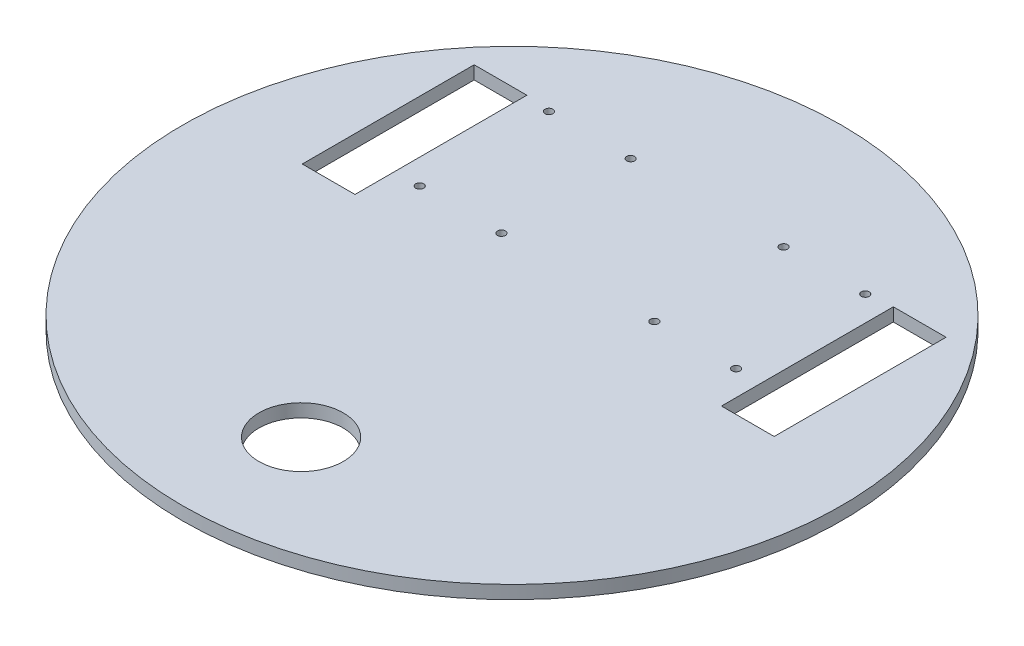
ISO-10303-21;
HEADER;
FILE_DESCRIPTION(('STEP AP214'),'2;1');
FILE_NAME('part.step','',(''),(''),'','','');
FILE_SCHEMA(('AUTOMOTIVE_DESIGN { 1 0 10303 214 1 1 1 1 }'));
ENDSEC;
DATA;
#1=APPLICATION_CONTEXT('core data for automotive mechanical design processes');
#2=APPLICATION_PROTOCOL_DEFINITION('international standard','automotive_design',2000,#1);
#3=PRODUCT_CONTEXT('',#1,'mechanical');
#4=PRODUCT('Part','Part','',(#3));
#5=PRODUCT_RELATED_PRODUCT_CATEGORY('part','',(#4));
#6=PRODUCT_DEFINITION_FORMATION('','',#4);
#7=PRODUCT_DEFINITION_CONTEXT('part definition',#1,'design');
#8=PRODUCT_DEFINITION('design','',#6,#7);
#9=PRODUCT_DEFINITION_SHAPE('','',#8);
#10=(LENGTH_UNIT() NAMED_UNIT(*) SI_UNIT(.MILLI.,.METRE.));
#11=(NAMED_UNIT(*) PLANE_ANGLE_UNIT() SI_UNIT($,.RADIAN.));
#12=(NAMED_UNIT(*) SI_UNIT($,.STERADIAN.) SOLID_ANGLE_UNIT());
#13=UNCERTAINTY_MEASURE_WITH_UNIT(LENGTH_MEASURE(1.E-05),#10,'distance_accuracy_value','');
#14=(GEOMETRIC_REPRESENTATION_CONTEXT(3) GLOBAL_UNCERTAINTY_ASSIGNED_CONTEXT((#13)) GLOBAL_UNIT_ASSIGNED_CONTEXT((#10,
#11,#12)) REPRESENTATION_CONTEXT('',''));
#15=CARTESIAN_POINT('',(0.,0.,0.));
#16=DIRECTION('',(0.,0.,1.));
#17=DIRECTION('',(1.,0.,0.));
#18=AXIS2_PLACEMENT_3D('',#15,#16,#17);
#19=CARTESIAN_POINT('',(0.,5.,6.98856147456448));
#20=DIRECTION('',(0.,1.,0.));
#21=DIRECTION('',(0.,0.,1.));
#22=AXIS2_PLACEMENT_3D('',#19,#20,#21);
#23=PLANE('',#22);
#24=CARTESIAN_POINT('',(-29.,5.,-67.0114385254356));
#25=DIRECTION('',(0.,1.,0.));
#26=DIRECTION('',(0.,0.,-1.));
#27=AXIS2_PLACEMENT_3D('',#24,#25,#26);
#28=CIRCLE('',#27,1.5);
#29=CARTESIAN_POINT('',(-29.,5.,-68.5114385254356));
#30=VERTEX_POINT('',#29);
#31=EDGE_CURVE('E140',#30,#30,#28,.T.);
#32=ORIENTED_EDGE('',*,*,#31,.F.);
#33=EDGE_LOOP('',(#32));
#34=FACE_BOUND('',#33,.T.);
#35=CARTESIAN_POINT('',(-60.,5.,-18.0114385254356));
#36=DIRECTION('',(0.,1.,0.));
#37=DIRECTION('',(0.,0.,-1.));
#38=AXIS2_PLACEMENT_3D('',#35,#36,#37);
#39=CIRCLE('',#38,1.5);
#40=CARTESIAN_POINT('',(-60.,5.,-19.5114385254356));
#41=VERTEX_POINT('',#40);
#42=EDGE_CURVE('E152',#41,#41,#39,.T.);
#43=ORIENTED_EDGE('',*,*,#42,.F.);
#44=EDGE_LOOP('',(#43));
#45=FACE_BOUND('',#44,.T.);
#46=CARTESIAN_POINT('',(29.,5.,-67.0114385254356));
#47=DIRECTION('',(0.,1.,0.));
#48=DIRECTION('',(0.,0.,1.));
#49=AXIS2_PLACEMENT_3D('',#46,#47,#48);
#50=CIRCLE('',#49,1.5);
#51=CARTESIAN_POINT('',(29.,5.,-65.5114385254356));
#52=VERTEX_POINT('',#51);
#53=EDGE_CURVE('E164',#52,#52,#50,.T.);
#54=ORIENTED_EDGE('',*,*,#53,.F.);
#55=EDGE_LOOP('',(#54));
#56=FACE_BOUND('',#55,.T.);
#57=CARTESIAN_POINT('',(60.,5.,-18.0114385254356));
#58=DIRECTION('',(0.,1.,0.));
#59=DIRECTION('',(0.,0.,1.));
#60=AXIS2_PLACEMENT_3D('',#57,#58,#59);
#61=CIRCLE('',#60,1.5);
#62=CARTESIAN_POINT('',(60.,5.,-16.5114385254356));
#63=VERTEX_POINT('',#62);
#64=EDGE_CURVE('E176',#63,#63,#61,.T.);
#65=ORIENTED_EDGE('',*,*,#64,.F.);
#66=EDGE_LOOP('',(#65));
#67=FACE_BOUND('',#66,.T.);
#68=DIRECTION('',(-1.,0.,0.));
#69=VECTOR('',#68,1.);
#70=CARTESIAN_POINT('',(69.5,5.,-68.1557008210805));
#71=LINE('',#70,#69);
#72=CARTESIAN_POINT('',(89.5,5.,-68.1557008210805));
#73=VERTEX_POINT('',#72);
#74=CARTESIAN_POINT('',(69.5,5.,-68.1557008210805));
#75=VERTEX_POINT('',#74);
#76=EDGE_CURVE('E190',#73,#75,#71,.T.);
#77=ORIENTED_EDGE('',*,*,#76,.F.);
#78=DIRECTION('',(0.,0.,-1.));
#79=VECTOR('',#78,1.);
#80=CARTESIAN_POINT('',(89.5,5.,-68.1557008210805));
#81=LINE('',#80,#79);
#82=CARTESIAN_POINT('',(89.5,5.,-2.95570082108054));
#83=VERTEX_POINT('',#82);
#84=EDGE_CURVE('E188',#83,#73,#81,.T.);
#85=ORIENTED_EDGE('',*,*,#84,.F.);
#86=DIRECTION('',(1.,0.,0.));
#87=VECTOR('',#86,1.);
#88=CARTESIAN_POINT('',(89.5,5.,-2.95570082108054));
#89=LINE('',#88,#87);
#90=CARTESIAN_POINT('',(69.5,5.,-2.95570082108054));
#91=VERTEX_POINT('',#90);
#92=EDGE_CURVE('E196',#91,#83,#89,.T.);
#93=ORIENTED_EDGE('',*,*,#92,.F.);
#94=DIRECTION('',(0.,0.,1.));
#95=VECTOR('',#94,1.);
#96=CARTESIAN_POINT('',(69.5,5.,-2.95570082108054));
#97=LINE('',#96,#95);
#98=EDGE_CURVE('E193',#75,#91,#97,.T.);
#99=ORIENTED_EDGE('',*,*,#98,.F.);
#100=EDGE_LOOP('',(#77,#85,#93,#99));
#101=FACE_BOUND('',#100,.T.);
#102=CARTESIAN_POINT('',(0.,5.,6.98856147456448));
#103=DIRECTION('',(0.,1.,0.));
#104=DIRECTION('',(0.,0.,1.));
#105=AXIS2_PLACEMENT_3D('',#102,#103,#104);
#106=CIRCLE('',#105,125.);
#107=CARTESIAN_POINT('',(0.,5.,131.988561474564));
#108=VERTEX_POINT('',#107);
#109=EDGE_CURVE('E11',#108,#108,#106,.T.);
#110=ORIENTED_EDGE('',*,*,#109,.T.);
#111=EDGE_LOOP('',(#110));
#112=FACE_BOUND('',#111,.T.);
#113=CARTESIAN_POINT('',(0.,5.,86.9885614745645));
#114=DIRECTION('',(0.,1.,0.));
#115=DIRECTION('',(0.,0.,1.));
#116=AXIS2_PLACEMENT_3D('',#113,#114,#115);
#117=CIRCLE('',#116,16.);
#118=CARTESIAN_POINT('',(0.,5.,102.988561474564));
#119=VERTEX_POINT('',#118);
#120=EDGE_CURVE('E182',#119,#119,#117,.T.);
#121=ORIENTED_EDGE('',*,*,#120,.F.);
#122=EDGE_LOOP('',(#121));
#123=FACE_BOUND('',#122,.T.);
#124=CARTESIAN_POINT('',(60.,5.,-67.0114385254356));
#125=DIRECTION('',(0.,1.,0.));
#126=DIRECTION('',(0.,0.,1.));
#127=AXIS2_PLACEMENT_3D('',#124,#125,#126);
#128=CIRCLE('',#127,1.5);
#129=CARTESIAN_POINT('',(60.,5.,-65.5114385254356));
#130=VERTEX_POINT('',#129);
#131=EDGE_CURVE('E170',#130,#130,#128,.T.);
#132=ORIENTED_EDGE('',*,*,#131,.F.);
#133=EDGE_LOOP('',(#132));
#134=FACE_BOUND('',#133,.T.);
#135=CARTESIAN_POINT('',(29.,5.,-18.0114385254356));
#136=DIRECTION('',(0.,1.,0.));
#137=DIRECTION('',(0.,0.,1.));
#138=AXIS2_PLACEMENT_3D('',#135,#136,#137);
#139=CIRCLE('',#138,1.5);
#140=CARTESIAN_POINT('',(29.,5.,-16.5114385254356));
#141=VERTEX_POINT('',#140);
#142=EDGE_CURVE('E158',#141,#141,#139,.T.);
#143=ORIENTED_EDGE('',*,*,#142,.F.);
#144=EDGE_LOOP('',(#143));
#145=FACE_BOUND('',#144,.T.);
#146=CARTESIAN_POINT('',(-29.,5.,-18.0114385254356));
#147=DIRECTION('',(0.,1.,0.));
#148=DIRECTION('',(0.,0.,-1.));
#149=AXIS2_PLACEMENT_3D('',#146,#147,#148);
#150=CIRCLE('',#149,1.5);
#151=CARTESIAN_POINT('',(-29.,5.,-19.5114385254356));
#152=VERTEX_POINT('',#151);
#153=EDGE_CURVE('E146',#152,#152,#150,.T.);
#154=ORIENTED_EDGE('',*,*,#153,.F.);
#155=EDGE_LOOP('',(#154));
#156=FACE_BOUND('',#155,.T.);
#157=CARTESIAN_POINT('',(-60.,5.,-67.0114385254356));
#158=DIRECTION('',(0.,1.,0.));
#159=DIRECTION('',(0.,0.,-1.));
#160=AXIS2_PLACEMENT_3D('',#157,#158,#159);
#161=CIRCLE('',#160,1.5);
#162=CARTESIAN_POINT('',(-60.,5.,-68.5114385254356));
#163=VERTEX_POINT('',#162);
#164=EDGE_CURVE('E134',#163,#163,#161,.T.);
#165=ORIENTED_EDGE('',*,*,#164,.F.);
#166=EDGE_LOOP('',(#165));
#167=FACE_BOUND('',#166,.T.);
#168=DIRECTION('',(-1.,0.,0.));
#169=VECTOR('',#168,1.);
#170=CARTESIAN_POINT('',(-69.5,5.,-68.1557008210805));
#171=LINE('',#170,#169);
#172=CARTESIAN_POINT('',(-69.5,5.,-68.1557008210805));
#173=VERTEX_POINT('',#172);
#174=CARTESIAN_POINT('',(-89.5,5.,-68.1557008210805));
#175=VERTEX_POINT('',#174);
#176=EDGE_CURVE('E106',#173,#175,#171,.T.);
#177=ORIENTED_EDGE('',*,*,#176,.F.);
#178=DIRECTION('',(0.,0.,-1.));
#179=VECTOR('',#178,1.);
#180=CARTESIAN_POINT('',(-69.5,5.,-2.95570082108054));
#181=LINE('',#180,#179);
#182=CARTESIAN_POINT('',(-69.5,5.,-2.95570082108054));
#183=VERTEX_POINT('',#182);
#184=EDGE_CURVE('E98',#183,#173,#181,.T.);
#185=ORIENTED_EDGE('',*,*,#184,.F.);
#186=DIRECTION('',(1.,0.,0.));
#187=VECTOR('',#186,1.);
#188=CARTESIAN_POINT('',(-89.5,5.,-2.95570082108054));
#189=LINE('',#188,#187);
#190=CARTESIAN_POINT('',(-89.5,5.,-2.95570082108054));
#191=VERTEX_POINT('',#190);
#192=EDGE_CURVE('E120',#191,#183,#189,.T.);
#193=ORIENTED_EDGE('',*,*,#192,.F.);
#194=DIRECTION('',(0.,0.,1.));
#195=VECTOR('',#194,1.);
#196=CARTESIAN_POINT('',(-89.5,5.,-68.1557008210805));
#197=LINE('',#196,#195);
#198=EDGE_CURVE('E118',#175,#191,#197,.T.);
#199=ORIENTED_EDGE('',*,*,#198,.F.);
#200=EDGE_LOOP('',(#177,#185,#193,#199));
#201=FACE_BOUND('',#200,.T.);
#202=ADVANCED_FACE('F33',(#34,#45,#56,#67,#101,#112,#123,#134,#145,#156,#167,#201),#23,.T.);
#203=CARTESIAN_POINT('',(0.,0.,6.98856147456448));
#204=DIRECTION('',(0.,1.,0.));
#205=DIRECTION('',(0.,0.,1.));
#206=AXIS2_PLACEMENT_3D('',#203,#204,#205);
#207=PLANE('',#206);
#208=CARTESIAN_POINT('',(-60.,0.,-67.0114385254356));
#209=DIRECTION('',(0.,1.,0.));
#210=DIRECTION('',(0.,0.,-1.));
#211=AXIS2_PLACEMENT_3D('',#208,#209,#210);
#212=CIRCLE('',#211,1.5);
#213=CARTESIAN_POINT('',(-60.,0.,-68.5114385254356));
#214=VERTEX_POINT('',#213);
#215=EDGE_CURVE('E114',#214,#214,#212,.T.);
#216=ORIENTED_EDGE('',*,*,#215,.T.);
#217=EDGE_LOOP('',(#216));
#218=FACE_BOUND('',#217,.T.);
#219=CARTESIAN_POINT('',(-29.,0.,-67.0114385254356));
#220=DIRECTION('',(0.,1.,0.));
#221=DIRECTION('',(0.,0.,-1.));
#222=AXIS2_PLACEMENT_3D('',#219,#220,#221);
#223=CIRCLE('',#222,1.5);
#224=CARTESIAN_POINT('',(-29.,0.,-68.5114385254356));
#225=VERTEX_POINT('',#224);
#226=EDGE_CURVE('E137',#225,#225,#223,.T.);
#227=ORIENTED_EDGE('',*,*,#226,.T.);
#228=EDGE_LOOP('',(#227));
#229=FACE_BOUND('',#228,.T.);
#230=CARTESIAN_POINT('',(-29.,0.,-18.0114385254356));
#231=DIRECTION('',(0.,1.,0.));
#232=DIRECTION('',(0.,0.,-1.));
#233=AXIS2_PLACEMENT_3D('',#230,#231,#232);
#234=CIRCLE('',#233,1.5);
#235=CARTESIAN_POINT('',(-29.,0.,-19.5114385254356));
#236=VERTEX_POINT('',#235);
#237=EDGE_CURVE('E143',#236,#236,#234,.T.);
#238=ORIENTED_EDGE('',*,*,#237,.T.);
#239=EDGE_LOOP('',(#238));
#240=FACE_BOUND('',#239,.T.);
#241=CARTESIAN_POINT('',(-60.,0.,-18.0114385254356));
#242=DIRECTION('',(0.,1.,0.));
#243=DIRECTION('',(0.,0.,-1.));
#244=AXIS2_PLACEMENT_3D('',#241,#242,#243);
#245=CIRCLE('',#244,1.5);
#246=CARTESIAN_POINT('',(-60.,0.,-19.5114385254356));
#247=VERTEX_POINT('',#246);
#248=EDGE_CURVE('E149',#247,#247,#245,.T.);
#249=ORIENTED_EDGE('',*,*,#248,.T.);
#250=EDGE_LOOP('',(#249));
#251=FACE_BOUND('',#250,.T.);
#252=CARTESIAN_POINT('',(29.,0.,-18.0114385254356));
#253=DIRECTION('',(0.,1.,0.));
#254=DIRECTION('',(0.,0.,1.));
#255=AXIS2_PLACEMENT_3D('',#252,#253,#254);
#256=CIRCLE('',#255,1.5);
#257=CARTESIAN_POINT('',(29.,0.,-16.5114385254356));
#258=VERTEX_POINT('',#257);
#259=EDGE_CURVE('E155',#258,#258,#256,.T.);
#260=ORIENTED_EDGE('',*,*,#259,.T.);
#261=EDGE_LOOP('',(#260));
#262=FACE_BOUND('',#261,.T.);
#263=CARTESIAN_POINT('',(29.,0.,-67.0114385254356));
#264=DIRECTION('',(0.,1.,0.));
#265=DIRECTION('',(0.,0.,1.));
#266=AXIS2_PLACEMENT_3D('',#263,#264,#265);
#267=CIRCLE('',#266,1.5);
#268=CARTESIAN_POINT('',(29.,0.,-65.5114385254356));
#269=VERTEX_POINT('',#268);
#270=EDGE_CURVE('E161',#269,#269,#267,.T.);
#271=ORIENTED_EDGE('',*,*,#270,.T.);
#272=EDGE_LOOP('',(#271));
#273=FACE_BOUND('',#272,.T.);
#274=CARTESIAN_POINT('',(60.,0.,-67.0114385254356));
#275=DIRECTION('',(0.,1.,0.));
#276=DIRECTION('',(0.,0.,1.));
#277=AXIS2_PLACEMENT_3D('',#274,#275,#276);
#278=CIRCLE('',#277,1.5);
#279=CARTESIAN_POINT('',(60.,0.,-65.5114385254356));
#280=VERTEX_POINT('',#279);
#281=EDGE_CURVE('E167',#280,#280,#278,.T.);
#282=ORIENTED_EDGE('',*,*,#281,.T.);
#283=EDGE_LOOP('',(#282));
#284=FACE_BOUND('',#283,.T.);
#285=CARTESIAN_POINT('',(60.,0.,-18.0114385254356));
#286=DIRECTION('',(0.,1.,0.));
#287=DIRECTION('',(0.,0.,1.));
#288=AXIS2_PLACEMENT_3D('',#285,#286,#287);
#289=CIRCLE('',#288,1.5);
#290=CARTESIAN_POINT('',(60.,0.,-16.5114385254356));
#291=VERTEX_POINT('',#290);
#292=EDGE_CURVE('E173',#291,#291,#289,.T.);
#293=ORIENTED_EDGE('',*,*,#292,.T.);
#294=EDGE_LOOP('',(#293));
#295=FACE_BOUND('',#294,.T.);
#296=CARTESIAN_POINT('',(0.,0.,86.9885614745645));
#297=DIRECTION('',(0.,1.,0.));
#298=DIRECTION('',(0.,0.,1.));
#299=AXIS2_PLACEMENT_3D('',#296,#297,#298);
#300=CIRCLE('',#299,16.);
#301=CARTESIAN_POINT('',(0.,0.,102.988561474564));
#302=VERTEX_POINT('',#301);
#303=EDGE_CURVE('E179',#302,#302,#300,.T.);
#304=ORIENTED_EDGE('',*,*,#303,.T.);
#305=EDGE_LOOP('',(#304));
#306=FACE_BOUND('',#305,.T.);
#307=DIRECTION('',(0.,0.,-1.));
#308=VECTOR('',#307,1.);
#309=CARTESIAN_POINT('',(89.5,0.,-68.1557008210805));
#310=LINE('',#309,#308);
#311=CARTESIAN_POINT('',(89.5,0.,-2.95570082108054));
#312=VERTEX_POINT('',#311);
#313=CARTESIAN_POINT('',(89.5,0.,-68.1557008210805));
#314=VERTEX_POINT('',#313);
#315=EDGE_CURVE('E185',#312,#314,#310,.T.);
#316=ORIENTED_EDGE('',*,*,#315,.T.);
#317=DIRECTION('',(-1.,0.,0.));
#318=VECTOR('',#317,1.);
#319=CARTESIAN_POINT('',(69.5,0.,-68.1557008210805));
#320=LINE('',#319,#318);
#321=CARTESIAN_POINT('',(69.5,0.,-68.1557008210805));
#322=VERTEX_POINT('',#321);
#323=EDGE_CURVE('E201',#314,#322,#320,.T.);
#324=ORIENTED_EDGE('',*,*,#323,.T.);
#325=DIRECTION('',(0.,0.,1.));
#326=VECTOR('',#325,1.);
#327=CARTESIAN_POINT('',(69.5,0.,-2.95570082108054));
#328=LINE('',#327,#326);
#329=CARTESIAN_POINT('',(69.5,0.,-2.95570082108054));
#330=VERTEX_POINT('',#329);
#331=EDGE_CURVE('E204',#322,#330,#328,.T.);
#332=ORIENTED_EDGE('',*,*,#331,.T.);
#333=DIRECTION('',(1.,0.,0.));
#334=VECTOR('',#333,1.);
#335=CARTESIAN_POINT('',(89.5,0.,-2.95570082108054));
#336=LINE('',#335,#334);
#337=EDGE_CURVE('E191',#330,#312,#336,.T.);
#338=ORIENTED_EDGE('',*,*,#337,.T.);
#339=EDGE_LOOP('',(#316,#324,#332,#338));
#340=FACE_BOUND('',#339,.T.);
#341=CARTESIAN_POINT('',(0.,0.,6.98856147456448));
#342=DIRECTION('',(0.,1.,0.));
#343=DIRECTION('',(0.,0.,1.));
#344=AXIS2_PLACEMENT_3D('',#341,#342,#343);
#345=CIRCLE('',#344,125.);
#346=CARTESIAN_POINT('',(0.,0.,131.988561474564));
#347=VERTEX_POINT('',#346);
#348=EDGE_CURVE('E37',#347,#347,#345,.T.);
#349=ORIENTED_EDGE('',*,*,#348,.F.);
#350=EDGE_LOOP('',(#349));
#351=FACE_BOUND('',#350,.T.);
#352=DIRECTION('',(0.,0.,-1.));
#353=VECTOR('',#352,1.);
#354=CARTESIAN_POINT('',(-69.5,0.,-2.95570082108054));
#355=LINE('',#354,#353);
#356=CARTESIAN_POINT('',(-69.5,0.,-2.95570082108054));
#357=VERTEX_POINT('',#356);
#358=CARTESIAN_POINT('',(-69.5,0.,-68.1557008210805));
#359=VERTEX_POINT('',#358);
#360=EDGE_CURVE('E56',#357,#359,#355,.T.);
#361=ORIENTED_EDGE('',*,*,#360,.T.);
#362=DIRECTION('',(-1.,0.,0.));
#363=VECTOR('',#362,1.);
#364=CARTESIAN_POINT('',(-69.5,0.,-68.1557008210805));
#365=LINE('',#364,#363);
#366=CARTESIAN_POINT('',(-89.5,0.,-68.1557008210805));
#367=VERTEX_POINT('',#366);
#368=EDGE_CURVE('E113',#359,#367,#365,.T.);
#369=ORIENTED_EDGE('',*,*,#368,.T.);
#370=DIRECTION('',(0.,0.,1.));
#371=VECTOR('',#370,1.);
#372=CARTESIAN_POINT('',(-89.5,0.,-68.1557008210805));
#373=LINE('',#372,#371);
#374=CARTESIAN_POINT('',(-89.5,0.,-2.95570082108054));
#375=VERTEX_POINT('',#374);
#376=EDGE_CURVE('E126',#367,#375,#373,.T.);
#377=ORIENTED_EDGE('',*,*,#376,.T.);
#378=DIRECTION('',(1.,0.,0.));
#379=VECTOR('',#378,1.);
#380=CARTESIAN_POINT('',(-89.5,0.,-2.95570082108054));
#381=LINE('',#380,#379);
#382=EDGE_CURVE('E107',#375,#357,#381,.T.);
#383=ORIENTED_EDGE('',*,*,#382,.T.);
#384=EDGE_LOOP('',(#361,#369,#377,#383));
#385=FACE_BOUND('',#384,.T.);
#386=ADVANCED_FACE('F223',(#218,#229,#240,#251,#262,#273,#284,#295,#306,#340,#351,#385),#207,.F.);
#387=CARTESIAN_POINT('',(0.,5.,6.98856147456448));
#388=DIRECTION('',(0.,-1.,0.));
#389=DIRECTION('',(0.,0.,-1.));
#390=AXIS2_PLACEMENT_3D('',#387,#388,#389);
#391=CYLINDRICAL_SURFACE('',#390,125.);
#392=ORIENTED_EDGE('',*,*,#109,.F.);
#393=EDGE_LOOP('',(#392));
#394=FACE_BOUND('',#393,.T.);
#395=ORIENTED_EDGE('',*,*,#348,.T.);
#396=EDGE_LOOP('',(#395));
#397=FACE_BOUND('',#396,.T.);
#398=ADVANCED_FACE('F35',(#394,#397),#391,.T.);
#399=CARTESIAN_POINT('',(89.5,5.,-68.1557008210805));
#400=DIRECTION('',(-1.,0.,0.));
#401=DIRECTION('',(0.,0.,1.));
#402=AXIS2_PLACEMENT_3D('',#399,#400,#401);
#403=PLANE('',#402);
#404=ORIENTED_EDGE('',*,*,#315,.F.);
#405=DIRECTION('',(0.,-1.,0.));
#406=VECTOR('',#405,1.);
#407=CARTESIAN_POINT('',(89.5,5.,-2.95570082108054));
#408=LINE('',#407,#406);
#409=EDGE_CURVE('E198',#83,#312,#408,.T.);
#410=ORIENTED_EDGE('',*,*,#409,.F.);
#411=ORIENTED_EDGE('',*,*,#84,.T.);
#412=DIRECTION('',(0.,-1.,0.));
#413=VECTOR('',#412,1.);
#414=CARTESIAN_POINT('',(89.5,5.,-68.1557008210805));
#415=LINE('',#414,#413);
#416=EDGE_CURVE('E215',#73,#314,#415,.T.);
#417=ORIENTED_EDGE('',*,*,#416,.T.);
#418=EDGE_LOOP('',(#404,#410,#411,#417));
#419=FACE_BOUND('',#418,.T.);
#420=ADVANCED_FACE('F245',(#419),#403,.T.);
#421=CARTESIAN_POINT('',(69.5,5.,-68.1557008210805));
#422=DIRECTION('',(0.,0.,1.));
#423=DIRECTION('',(1.,0.,0.));
#424=AXIS2_PLACEMENT_3D('',#421,#422,#423);
#425=PLANE('',#424);
#426=ORIENTED_EDGE('',*,*,#323,.F.);
#427=ORIENTED_EDGE('',*,*,#416,.F.);
#428=ORIENTED_EDGE('',*,*,#76,.T.);
#429=DIRECTION('',(0.,-1.,0.));
#430=VECTOR('',#429,1.);
#431=CARTESIAN_POINT('',(69.5,5.,-68.1557008210805));
#432=LINE('',#431,#430);
#433=EDGE_CURVE('E213',#75,#322,#432,.T.);
#434=ORIENTED_EDGE('',*,*,#433,.T.);
#435=EDGE_LOOP('',(#426,#427,#428,#434));
#436=FACE_BOUND('',#435,.T.);
#437=ADVANCED_FACE('F248',(#436),#425,.T.);
#438=CARTESIAN_POINT('',(69.5,5.,-2.95570082108054));
#439=DIRECTION('',(1.,0.,0.));
#440=DIRECTION('',(0.,0.,-1.));
#441=AXIS2_PLACEMENT_3D('',#438,#439,#440);
#442=PLANE('',#441);
#443=ORIENTED_EDGE('',*,*,#331,.F.);
#444=ORIENTED_EDGE('',*,*,#433,.F.);
#445=ORIENTED_EDGE('',*,*,#98,.T.);
#446=DIRECTION('',(0.,-1.,0.));
#447=VECTOR('',#446,1.);
#448=CARTESIAN_POINT('',(69.5,5.,-2.95570082108054));
#449=LINE('',#448,#447);
#450=EDGE_CURVE('E211',#91,#330,#449,.T.);
#451=ORIENTED_EDGE('',*,*,#450,.T.);
#452=EDGE_LOOP('',(#443,#444,#445,#451));
#453=FACE_BOUND('',#452,.T.);
#454=ADVANCED_FACE('F251',(#453),#442,.T.);
#455=CARTESIAN_POINT('',(89.5,5.,-2.95570082108054));
#456=DIRECTION('',(0.,0.,-1.));
#457=DIRECTION('',(-1.,0.,0.));
#458=AXIS2_PLACEMENT_3D('',#455,#456,#457);
#459=PLANE('',#458);
#460=ORIENTED_EDGE('',*,*,#337,.F.);
#461=ORIENTED_EDGE('',*,*,#450,.F.);
#462=ORIENTED_EDGE('',*,*,#92,.T.);
#463=ORIENTED_EDGE('',*,*,#409,.T.);
#464=EDGE_LOOP('',(#460,#461,#462,#463));
#465=FACE_BOUND('',#464,.T.);
#466=ADVANCED_FACE('F255',(#465),#459,.T.);
#467=CARTESIAN_POINT('',(0.,5.,86.9885614745645));
#468=DIRECTION('',(0.,-1.,0.));
#469=DIRECTION('',(0.,0.,-1.));
#470=AXIS2_PLACEMENT_3D('',#467,#468,#469);
#471=CYLINDRICAL_SURFACE('',#470,16.);
#472=ORIENTED_EDGE('',*,*,#120,.T.);
#473=EDGE_LOOP('',(#472));
#474=FACE_BOUND('',#473,.T.);
#475=ORIENTED_EDGE('',*,*,#303,.F.);
#476=EDGE_LOOP('',(#475));
#477=FACE_BOUND('',#476,.T.);
#478=ADVANCED_FACE('F259',(#474,#477),#471,.F.);
#479=CARTESIAN_POINT('',(60.,5.,-18.0114385254356));
#480=DIRECTION('',(0.,-1.,0.));
#481=DIRECTION('',(0.,0.,-1.));
#482=AXIS2_PLACEMENT_3D('',#479,#480,#481);
#483=CYLINDRICAL_SURFACE('',#482,1.5);
#484=ORIENTED_EDGE('',*,*,#64,.T.);
#485=EDGE_LOOP('',(#484));
#486=FACE_BOUND('',#485,.T.);
#487=ORIENTED_EDGE('',*,*,#292,.F.);
#488=EDGE_LOOP('',(#487));
#489=FACE_BOUND('',#488,.T.);
#490=ADVANCED_FACE('F263',(#486,#489),#483,.F.);
#491=CARTESIAN_POINT('',(60.,5.,-67.0114385254356));
#492=DIRECTION('',(0.,-1.,0.));
#493=DIRECTION('',(0.,0.,-1.));
#494=AXIS2_PLACEMENT_3D('',#491,#492,#493);
#495=CYLINDRICAL_SURFACE('',#494,1.5);
#496=ORIENTED_EDGE('',*,*,#131,.T.);
#497=EDGE_LOOP('',(#496));
#498=FACE_BOUND('',#497,.T.);
#499=ORIENTED_EDGE('',*,*,#281,.F.);
#500=EDGE_LOOP('',(#499));
#501=FACE_BOUND('',#500,.T.);
#502=ADVANCED_FACE('F267',(#498,#501),#495,.F.);
#503=CARTESIAN_POINT('',(29.,5.,-67.0114385254356));
#504=DIRECTION('',(0.,-1.,0.));
#505=DIRECTION('',(0.,0.,-1.));
#506=AXIS2_PLACEMENT_3D('',#503,#504,#505);
#507=CYLINDRICAL_SURFACE('',#506,1.5);
#508=ORIENTED_EDGE('',*,*,#53,.T.);
#509=EDGE_LOOP('',(#508));
#510=FACE_BOUND('',#509,.T.);
#511=ORIENTED_EDGE('',*,*,#270,.F.);
#512=EDGE_LOOP('',(#511));
#513=FACE_BOUND('',#512,.T.);
#514=ADVANCED_FACE('F271',(#510,#513),#507,.F.);
#515=CARTESIAN_POINT('',(29.,5.,-18.0114385254356));
#516=DIRECTION('',(0.,-1.,0.));
#517=DIRECTION('',(0.,0.,-1.));
#518=AXIS2_PLACEMENT_3D('',#515,#516,#517);
#519=CYLINDRICAL_SURFACE('',#518,1.5);
#520=ORIENTED_EDGE('',*,*,#142,.T.);
#521=EDGE_LOOP('',(#520));
#522=FACE_BOUND('',#521,.T.);
#523=ORIENTED_EDGE('',*,*,#259,.F.);
#524=EDGE_LOOP('',(#523));
#525=FACE_BOUND('',#524,.T.);
#526=ADVANCED_FACE('F275',(#522,#525),#519,.F.);
#527=CARTESIAN_POINT('',(-60.,5.,-18.0114385254356));
#528=DIRECTION('',(0.,-1.,0.));
#529=DIRECTION('',(0.,0.,-1.));
#530=AXIS2_PLACEMENT_3D('',#527,#528,#529);
#531=CYLINDRICAL_SURFACE('',#530,1.5);
#532=ORIENTED_EDGE('',*,*,#42,.T.);
#533=EDGE_LOOP('',(#532));
#534=FACE_BOUND('',#533,.T.);
#535=ORIENTED_EDGE('',*,*,#248,.F.);
#536=EDGE_LOOP('',(#535));
#537=FACE_BOUND('',#536,.T.);
#538=ADVANCED_FACE('F279',(#534,#537),#531,.F.);
#539=CARTESIAN_POINT('',(-29.,5.,-18.0114385254356));
#540=DIRECTION('',(0.,-1.,0.));
#541=DIRECTION('',(0.,0.,-1.));
#542=AXIS2_PLACEMENT_3D('',#539,#540,#541);
#543=CYLINDRICAL_SURFACE('',#542,1.5);
#544=ORIENTED_EDGE('',*,*,#153,.T.);
#545=EDGE_LOOP('',(#544));
#546=FACE_BOUND('',#545,.T.);
#547=ORIENTED_EDGE('',*,*,#237,.F.);
#548=EDGE_LOOP('',(#547));
#549=FACE_BOUND('',#548,.T.);
#550=ADVANCED_FACE('F283',(#546,#549),#543,.F.);
#551=CARTESIAN_POINT('',(-29.,5.,-67.0114385254356));
#552=DIRECTION('',(0.,-1.,0.));
#553=DIRECTION('',(0.,0.,-1.));
#554=AXIS2_PLACEMENT_3D('',#551,#552,#553);
#555=CYLINDRICAL_SURFACE('',#554,1.5);
#556=ORIENTED_EDGE('',*,*,#31,.T.);
#557=EDGE_LOOP('',(#556));
#558=FACE_BOUND('',#557,.T.);
#559=ORIENTED_EDGE('',*,*,#226,.F.);
#560=EDGE_LOOP('',(#559));
#561=FACE_BOUND('',#560,.T.);
#562=ADVANCED_FACE('F287',(#558,#561),#555,.F.);
#563=CARTESIAN_POINT('',(-60.,5.,-67.0114385254356));
#564=DIRECTION('',(0.,-1.,0.));
#565=DIRECTION('',(0.,0.,-1.));
#566=AXIS2_PLACEMENT_3D('',#563,#564,#565);
#567=CYLINDRICAL_SURFACE('',#566,1.5);
#568=ORIENTED_EDGE('',*,*,#164,.T.);
#569=EDGE_LOOP('',(#568));
#570=FACE_BOUND('',#569,.T.);
#571=ORIENTED_EDGE('',*,*,#215,.F.);
#572=EDGE_LOOP('',(#571));
#573=FACE_BOUND('',#572,.T.);
#574=ADVANCED_FACE('F291',(#570,#573),#567,.F.);
#575=CARTESIAN_POINT('',(-69.5,5.,-2.95570082108054));
#576=DIRECTION('',(-1.,0.,0.));
#577=DIRECTION('',(0.,0.,1.));
#578=AXIS2_PLACEMENT_3D('',#575,#576,#577);
#579=PLANE('',#578);
#580=ORIENTED_EDGE('',*,*,#360,.F.);
#581=DIRECTION('',(0.,-1.,0.));
#582=VECTOR('',#581,1.);
#583=CARTESIAN_POINT('',(-69.5,5.,-2.95570082108054));
#584=LINE('',#583,#582);
#585=EDGE_CURVE('E102',#183,#357,#584,.T.);
#586=ORIENTED_EDGE('',*,*,#585,.F.);
#587=ORIENTED_EDGE('',*,*,#184,.T.);
#588=DIRECTION('',(0.,-1.,0.));
#589=VECTOR('',#588,1.);
#590=CARTESIAN_POINT('',(-69.5,5.,-68.1557008210805));
#591=LINE('',#590,#589);
#592=EDGE_CURVE('E101',#173,#359,#591,.T.);
#593=ORIENTED_EDGE('',*,*,#592,.T.);
#594=EDGE_LOOP('',(#580,#586,#587,#593));
#595=FACE_BOUND('',#594,.T.);
#596=ADVANCED_FACE('F100',(#595),#579,.T.);
#597=CARTESIAN_POINT('',(-69.5,5.,-68.1557008210805));
#598=DIRECTION('',(0.,0.,1.));
#599=DIRECTION('',(1.,0.,0.));
#600=AXIS2_PLACEMENT_3D('',#597,#598,#599);
#601=PLANE('',#600);
#602=ORIENTED_EDGE('',*,*,#368,.F.);
#603=ORIENTED_EDGE('',*,*,#592,.F.);
#604=ORIENTED_EDGE('',*,*,#176,.T.);
#605=DIRECTION('',(0.,-1.,0.));
#606=VECTOR('',#605,1.);
#607=CARTESIAN_POINT('',(-89.5,5.,-68.1557008210805));
#608=LINE('',#607,#606);
#609=EDGE_CURVE('E115',#175,#367,#608,.T.);
#610=ORIENTED_EDGE('',*,*,#609,.T.);
#611=EDGE_LOOP('',(#602,#603,#604,#610));
#612=FACE_BOUND('',#611,.T.);
#613=ADVANCED_FACE('F110',(#612),#601,.T.);
#614=CARTESIAN_POINT('',(-89.5,5.,-68.1557008210805));
#615=DIRECTION('',(1.,0.,0.));
#616=DIRECTION('',(0.,0.,-1.));
#617=AXIS2_PLACEMENT_3D('',#614,#615,#616);
#618=PLANE('',#617);
#619=ORIENTED_EDGE('',*,*,#376,.F.);
#620=ORIENTED_EDGE('',*,*,#609,.F.);
#621=ORIENTED_EDGE('',*,*,#198,.T.);
#622=DIRECTION('',(0.,-1.,0.));
#623=VECTOR('',#622,1.);
#624=CARTESIAN_POINT('',(-89.5,5.,-2.95570082108054));
#625=LINE('',#624,#623);
#626=EDGE_CURVE('E48',#191,#375,#625,.T.);
#627=ORIENTED_EDGE('',*,*,#626,.T.);
#628=EDGE_LOOP('',(#619,#620,#621,#627));
#629=FACE_BOUND('',#628,.T.);
#630=ADVANCED_FACE('F230',(#629),#618,.T.);
#631=CARTESIAN_POINT('',(-89.5,5.,-2.95570082108054));
#632=DIRECTION('',(0.,0.,-1.));
#633=DIRECTION('',(-1.,0.,0.));
#634=AXIS2_PLACEMENT_3D('',#631,#632,#633);
#635=PLANE('',#634);
#636=ORIENTED_EDGE('',*,*,#382,.F.);
#637=ORIENTED_EDGE('',*,*,#626,.F.);
#638=ORIENTED_EDGE('',*,*,#192,.T.);
#639=ORIENTED_EDGE('',*,*,#585,.T.);
#640=EDGE_LOOP('',(#636,#637,#638,#639));
#641=FACE_BOUND('',#640,.T.);
#642=ADVANCED_FACE('F228',(#641),#635,.T.);
#643=CLOSED_SHELL('',(#202,#386,#398,#420,#437,#454,#466,#478,#490,#502,#514,#526,#538,#550,
#562,#574,#596,#613,#630,#642));
#644=MANIFOLD_SOLID_BREP('B2',#643);
#645=ADVANCED_BREP_SHAPE_REPRESENTATION('',(#18,#644),#14);
#646=SHAPE_DEFINITION_REPRESENTATION(#9,#645);
ENDSEC;
END-ISO-10303-21;
